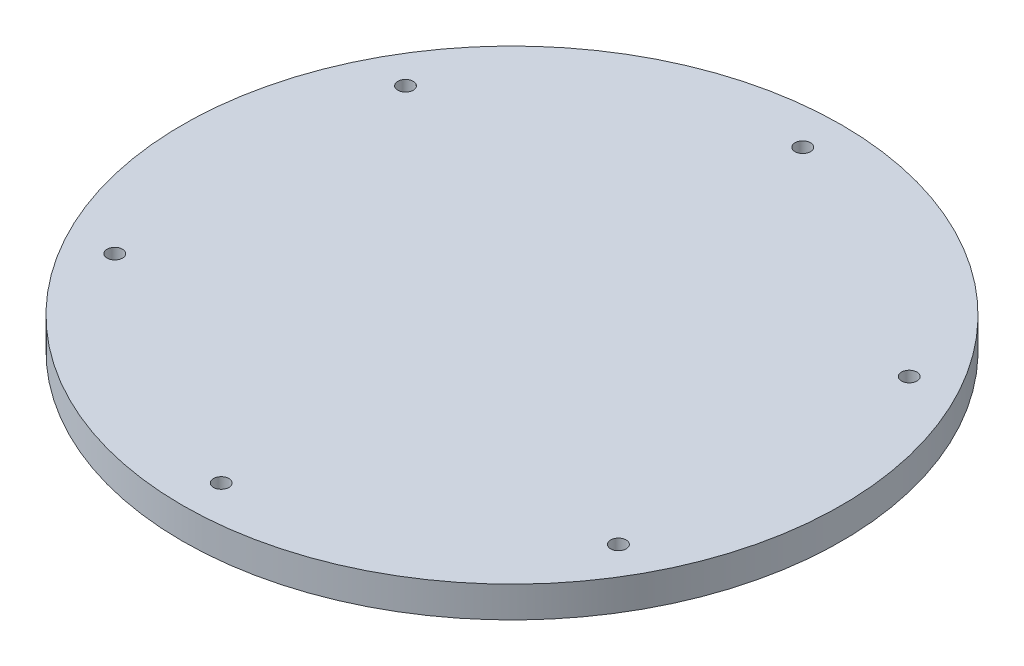
ISO-10303-21;
HEADER;
FILE_DESCRIPTION(('STEP AP214'),'2;1');
FILE_NAME('part.step','',(''),(''),'','','');
FILE_SCHEMA(('AUTOMOTIVE_DESIGN { 1 0 10303 214 1 1 1 1 }'));
ENDSEC;
DATA;
#1=APPLICATION_CONTEXT('core data for automotive mechanical design processes');
#2=APPLICATION_PROTOCOL_DEFINITION('international standard','automotive_design',2000,#1);
#3=PRODUCT_CONTEXT('',#1,'mechanical');
#4=PRODUCT('Part','Part','',(#3));
#5=PRODUCT_RELATED_PRODUCT_CATEGORY('part','',(#4));
#6=PRODUCT_DEFINITION_FORMATION('','',#4);
#7=PRODUCT_DEFINITION_CONTEXT('part definition',#1,'design');
#8=PRODUCT_DEFINITION('design','',#6,#7);
#9=PRODUCT_DEFINITION_SHAPE('','',#8);
#10=(LENGTH_UNIT() NAMED_UNIT(*) SI_UNIT(.MILLI.,.METRE.));
#11=(NAMED_UNIT(*) PLANE_ANGLE_UNIT() SI_UNIT($,.RADIAN.));
#12=(NAMED_UNIT(*) SI_UNIT($,.STERADIAN.) SOLID_ANGLE_UNIT());
#13=UNCERTAINTY_MEASURE_WITH_UNIT(LENGTH_MEASURE(1.E-05),#10,'distance_accuracy_value','');
#14=(GEOMETRIC_REPRESENTATION_CONTEXT(3) GLOBAL_UNCERTAINTY_ASSIGNED_CONTEXT((#13)) GLOBAL_UNIT_ASSIGNED_CONTEXT((#10,
#11,#12)) REPRESENTATION_CONTEXT('',''));
#15=CARTESIAN_POINT('',(0.,0.,0.));
#16=DIRECTION('',(0.,0.,1.));
#17=DIRECTION('',(1.,0.,0.));
#18=AXIS2_PLACEMENT_3D('',#15,#16,#17);
#19=CARTESIAN_POINT('',(0.,8.,0.));
#20=DIRECTION('',(0.,-1.,0.));
#21=DIRECTION('',(0.,0.,-1.));
#22=AXIS2_PLACEMENT_3D('',#19,#20,#21);
#23=CYLINDRICAL_SURFACE('',#22,85.);
#24=CARTESIAN_POINT('',(0.,8.,0.));
#25=DIRECTION('',(0.,1.,0.));
#26=DIRECTION('',(0.,0.,1.));
#27=AXIS2_PLACEMENT_3D('',#24,#25,#26);
#28=CIRCLE('',#27,85.);
#29=CARTESIAN_POINT('',(0.,8.,85.));
#30=VERTEX_POINT('',#29);
#31=EDGE_CURVE('E10',#30,#30,#28,.T.);
#32=ORIENTED_EDGE('',*,*,#31,.F.);
#33=EDGE_LOOP('',(#32));
#34=FACE_BOUND('',#33,.T.);
#35=CARTESIAN_POINT('',(0.,0.,0.));
#36=DIRECTION('',(0.,1.,0.));
#37=DIRECTION('',(0.,0.,1.));
#38=AXIS2_PLACEMENT_3D('',#35,#36,#37);
#39=CIRCLE('',#38,85.);
#40=CARTESIAN_POINT('',(0.,0.,85.));
#41=VERTEX_POINT('',#40);
#42=EDGE_CURVE('E40',#41,#41,#39,.T.);
#43=ORIENTED_EDGE('',*,*,#42,.T.);
#44=EDGE_LOOP('',(#43));
#45=FACE_BOUND('',#44,.T.);
#46=ADVANCED_FACE('F37',(#34,#45),#23,.T.);
#47=CARTESIAN_POINT('',(0.,8.,0.));
#48=DIRECTION('',(0.,1.,0.));
#49=DIRECTION('',(0.,0.,1.));
#50=AXIS2_PLACEMENT_3D('',#47,#48,#49);
#51=PLANE('',#50);
#52=CARTESIAN_POINT('',(64.9519052838325,8.,37.5000000000008));
#53=DIRECTION('',(0.,1.,0.));
#54=DIRECTION('',(0.,0.,1.));
#55=AXIS2_PLACEMENT_3D('',#52,#53,#54);
#56=CIRCLE('',#55,2.00000000000001);
#57=CARTESIAN_POINT('',(64.9519052838325,8.,39.5000000000008));
#58=VERTEX_POINT('',#57);
#59=EDGE_CURVE('E63',#58,#58,#56,.T.);
#60=ORIENTED_EDGE('',*,*,#59,.F.);
#61=EDGE_LOOP('',(#60));
#62=FACE_BOUND('',#61,.T.);
#63=CARTESIAN_POINT('',(0.,8.,75.));
#64=DIRECTION('',(0.,1.,0.));
#65=DIRECTION('',(0.,0.,1.));
#66=AXIS2_PLACEMENT_3D('',#63,#64,#65);
#67=CIRCLE('',#66,2.);
#68=CARTESIAN_POINT('',(0.,8.,77.));
#69=VERTEX_POINT('',#68);
#70=EDGE_CURVE('E71',#69,#69,#67,.T.);
#71=ORIENTED_EDGE('',*,*,#70,.F.);
#72=EDGE_LOOP('',(#71));
#73=FACE_BOUND('',#72,.T.);
#74=CARTESIAN_POINT('',(-64.951905283833,8.,37.4999999999999));
#75=DIRECTION('',(0.,1.,0.));
#76=DIRECTION('',(0.,0.,1.));
#77=AXIS2_PLACEMENT_3D('',#74,#75,#76);
#78=CIRCLE('',#77,2.00000000000001);
#79=CARTESIAN_POINT('',(-64.951905283833,8.,39.4999999999999));
#80=VERTEX_POINT('',#79);
#81=EDGE_CURVE('E79',#80,#80,#78,.T.);
#82=ORIENTED_EDGE('',*,*,#81,.F.);
#83=EDGE_LOOP('',(#82));
#84=FACE_BOUND('',#83,.T.);
#85=CARTESIAN_POINT('',(-64.9519052838327,8.,-37.5000000000003));
#86=DIRECTION('',(0.,1.,0.));
#87=DIRECTION('',(0.,0.,1.));
#88=AXIS2_PLACEMENT_3D('',#85,#86,#87);
#89=CIRCLE('',#88,2.);
#90=CARTESIAN_POINT('',(-64.9519052838327,8.,-35.5000000000003));
#91=VERTEX_POINT('',#90);
#92=EDGE_CURVE('E87',#91,#91,#89,.T.);
#93=ORIENTED_EDGE('',*,*,#92,.F.);
#94=EDGE_LOOP('',(#93));
#95=FACE_BOUND('',#94,.T.);
#96=CARTESIAN_POINT('',(5.2372220082647E-13,8.,-75.));
#97=DIRECTION('',(0.,1.,0.));
#98=DIRECTION('',(0.,0.,1.));
#99=AXIS2_PLACEMENT_3D('',#96,#97,#98);
#100=CIRCLE('',#99,2.);
#101=CARTESIAN_POINT('',(5.2372220082647E-13,8.,-73.));
#102=VERTEX_POINT('',#101);
#103=EDGE_CURVE('E55',#102,#102,#100,.T.);
#104=ORIENTED_EDGE('',*,*,#103,.F.);
#105=EDGE_LOOP('',(#104));
#106=FACE_BOUND('',#105,.T.);
#107=CARTESIAN_POINT('',(64.9519052838333,8.,-37.4999999999994));
#108=DIRECTION('',(0.,1.,0.));
#109=DIRECTION('',(0.,0.,1.));
#110=AXIS2_PLACEMENT_3D('',#107,#108,#109);
#111=CIRCLE('',#110,2.);
#112=CARTESIAN_POINT('',(64.9519052838333,8.,-35.4999999999994));
#113=VERTEX_POINT('',#112);
#114=EDGE_CURVE('E51',#113,#113,#111,.T.);
#115=ORIENTED_EDGE('',*,*,#114,.F.);
#116=EDGE_LOOP('',(#115));
#117=FACE_BOUND('',#116,.T.);
#118=ORIENTED_EDGE('',*,*,#31,.T.);
#119=EDGE_LOOP('',(#118));
#120=FACE_BOUND('',#119,.T.);
#121=ADVANCED_FACE('F101',(#62,#73,#84,#95,#106,#117,#120),#51,.T.);
#122=CARTESIAN_POINT('',(0.,0.,0.));
#123=DIRECTION('',(0.,1.,0.));
#124=DIRECTION('',(0.,0.,1.));
#125=AXIS2_PLACEMENT_3D('',#122,#123,#124);
#126=PLANE('',#125);
#127=CARTESIAN_POINT('',(64.9519052838325,0.,37.5000000000008));
#128=DIRECTION('',(0.,1.,0.));
#129=DIRECTION('',(0.,0.,1.));
#130=AXIS2_PLACEMENT_3D('',#127,#128,#129);
#131=CIRCLE('',#130,2.00000000000001);
#132=CARTESIAN_POINT('',(64.9519052838325,0.,39.5000000000008));
#133=VERTEX_POINT('',#132);
#134=EDGE_CURVE('E59',#133,#133,#131,.T.);
#135=ORIENTED_EDGE('',*,*,#134,.T.);
#136=EDGE_LOOP('',(#135));
#137=FACE_BOUND('',#136,.T.);
#138=CARTESIAN_POINT('',(0.,0.,75.));
#139=DIRECTION('',(0.,1.,0.));
#140=DIRECTION('',(0.,0.,1.));
#141=AXIS2_PLACEMENT_3D('',#138,#139,#140);
#142=CIRCLE('',#141,2.);
#143=CARTESIAN_POINT('',(0.,0.,77.));
#144=VERTEX_POINT('',#143);
#145=EDGE_CURVE('E67',#144,#144,#142,.T.);
#146=ORIENTED_EDGE('',*,*,#145,.T.);
#147=EDGE_LOOP('',(#146));
#148=FACE_BOUND('',#147,.T.);
#149=CARTESIAN_POINT('',(-64.951905283833,0.,37.4999999999999));
#150=DIRECTION('',(0.,1.,0.));
#151=DIRECTION('',(0.,0.,1.));
#152=AXIS2_PLACEMENT_3D('',#149,#150,#151);
#153=CIRCLE('',#152,2.00000000000001);
#154=CARTESIAN_POINT('',(-64.951905283833,0.,39.4999999999999));
#155=VERTEX_POINT('',#154);
#156=EDGE_CURVE('E75',#155,#155,#153,.T.);
#157=ORIENTED_EDGE('',*,*,#156,.T.);
#158=EDGE_LOOP('',(#157));
#159=FACE_BOUND('',#158,.T.);
#160=CARTESIAN_POINT('',(-64.9519052838327,0.,-37.5000000000003));
#161=DIRECTION('',(0.,1.,0.));
#162=DIRECTION('',(0.,0.,1.));
#163=AXIS2_PLACEMENT_3D('',#160,#161,#162);
#164=CIRCLE('',#163,2.);
#165=CARTESIAN_POINT('',(-64.9519052838327,0.,-35.5000000000003));
#166=VERTEX_POINT('',#165);
#167=EDGE_CURVE('E83',#166,#166,#164,.T.);
#168=ORIENTED_EDGE('',*,*,#167,.T.);
#169=EDGE_LOOP('',(#168));
#170=FACE_BOUND('',#169,.T.);
#171=CARTESIAN_POINT('',(5.2372220082647E-13,0.,-75.));
#172=DIRECTION('',(0.,1.,0.));
#173=DIRECTION('',(0.,0.,1.));
#174=AXIS2_PLACEMENT_3D('',#171,#172,#173);
#175=CIRCLE('',#174,2.);
#176=CARTESIAN_POINT('',(5.2372220082647E-13,0.,-73.));
#177=VERTEX_POINT('',#176);
#178=EDGE_CURVE('E91',#177,#177,#175,.T.);
#179=ORIENTED_EDGE('',*,*,#178,.T.);
#180=EDGE_LOOP('',(#179));
#181=FACE_BOUND('',#180,.T.);
#182=CARTESIAN_POINT('',(64.9519052838333,0.,-37.4999999999994));
#183=DIRECTION('',(0.,1.,0.));
#184=DIRECTION('',(0.,0.,1.));
#185=AXIS2_PLACEMENT_3D('',#182,#183,#184);
#186=CIRCLE('',#185,2.);
#187=CARTESIAN_POINT('',(64.9519052838333,0.,-35.4999999999994));
#188=VERTEX_POINT('',#187);
#189=EDGE_CURVE('E49',#188,#188,#186,.T.);
#190=ORIENTED_EDGE('',*,*,#189,.T.);
#191=EDGE_LOOP('',(#190));
#192=FACE_BOUND('',#191,.T.);
#193=ORIENTED_EDGE('',*,*,#42,.F.);
#194=EDGE_LOOP('',(#193));
#195=FACE_BOUND('',#194,.T.);
#196=ADVANCED_FACE('F104',(#137,#148,#159,#170,#181,#192,#195),#126,.F.);
#197=CARTESIAN_POINT('',(64.9519052838333,0.,-37.4999999999994));
#198=DIRECTION('',(0.,1.,0.));
#199=DIRECTION('',(0.,0.,1.));
#200=AXIS2_PLACEMENT_3D('',#197,#198,#199);
#201=CYLINDRICAL_SURFACE('',#200,2.);
#202=ORIENTED_EDGE('',*,*,#189,.F.);
#203=EDGE_LOOP('',(#202));
#204=FACE_BOUND('',#203,.T.);
#205=ORIENTED_EDGE('',*,*,#114,.T.);
#206=EDGE_LOOP('',(#205));
#207=FACE_BOUND('',#206,.T.);
#208=ADVANCED_FACE('F109',(#204,#207),#201,.F.);
#209=CARTESIAN_POINT('',(5.2372220082647E-13,0.,-75.));
#210=DIRECTION('',(0.,1.,0.));
#211=DIRECTION('',(0.,0.,1.));
#212=AXIS2_PLACEMENT_3D('',#209,#210,#211);
#213=CYLINDRICAL_SURFACE('',#212,2.);
#214=ORIENTED_EDGE('',*,*,#178,.F.);
#215=EDGE_LOOP('',(#214));
#216=FACE_BOUND('',#215,.T.);
#217=ORIENTED_EDGE('',*,*,#103,.T.);
#218=EDGE_LOOP('',(#217));
#219=FACE_BOUND('',#218,.T.);
#220=ADVANCED_FACE('F99',(#216,#219),#213,.F.);
#221=CARTESIAN_POINT('',(-64.9519052838327,0.,-37.5000000000003));
#222=DIRECTION('',(0.,1.,0.));
#223=DIRECTION('',(0.,0.,1.));
#224=AXIS2_PLACEMENT_3D('',#221,#222,#223);
#225=CYLINDRICAL_SURFACE('',#224,2.);
#226=ORIENTED_EDGE('',*,*,#167,.F.);
#227=EDGE_LOOP('',(#226));
#228=FACE_BOUND('',#227,.T.);
#229=ORIENTED_EDGE('',*,*,#92,.T.);
#230=EDGE_LOOP('',(#229));
#231=FACE_BOUND('',#230,.T.);
#232=ADVANCED_FACE('F117',(#228,#231),#225,.F.);
#233=CARTESIAN_POINT('',(-64.951905283833,0.,37.4999999999999));
#234=DIRECTION('',(0.,1.,0.));
#235=DIRECTION('',(0.,0.,1.));
#236=AXIS2_PLACEMENT_3D('',#233,#234,#235);
#237=CYLINDRICAL_SURFACE('',#236,2.00000000000001);
#238=ORIENTED_EDGE('',*,*,#156,.F.);
#239=EDGE_LOOP('',(#238));
#240=FACE_BOUND('',#239,.T.);
#241=ORIENTED_EDGE('',*,*,#81,.T.);
#242=EDGE_LOOP('',(#241));
#243=FACE_BOUND('',#242,.T.);
#244=ADVANCED_FACE('F157',(#240,#243),#237,.F.);
#245=CARTESIAN_POINT('',(0.,0.,75.));
#246=DIRECTION('',(0.,1.,0.));
#247=DIRECTION('',(0.,0.,1.));
#248=AXIS2_PLACEMENT_3D('',#245,#246,#247);
#249=CYLINDRICAL_SURFACE('',#248,2.);
#250=ORIENTED_EDGE('',*,*,#145,.F.);
#251=EDGE_LOOP('',(#250));
#252=FACE_BOUND('',#251,.T.);
#253=ORIENTED_EDGE('',*,*,#70,.T.);
#254=EDGE_LOOP('',(#253));
#255=FACE_BOUND('',#254,.T.);
#256=ADVANCED_FACE('F167',(#252,#255),#249,.F.);
#257=CARTESIAN_POINT('',(64.9519052838325,0.,37.5000000000008));
#258=DIRECTION('',(0.,1.,0.));
#259=DIRECTION('',(0.,0.,1.));
#260=AXIS2_PLACEMENT_3D('',#257,#258,#259);
#261=CYLINDRICAL_SURFACE('',#260,2.00000000000001);
#262=ORIENTED_EDGE('',*,*,#134,.F.);
#263=EDGE_LOOP('',(#262));
#264=FACE_BOUND('',#263,.T.);
#265=ORIENTED_EDGE('',*,*,#59,.T.);
#266=EDGE_LOOP('',(#265));
#267=FACE_BOUND('',#266,.T.);
#268=ADVANCED_FACE('F177',(#264,#267),#261,.F.);
#269=CLOSED_SHELL('',(#46,#121,#196,#208,#220,#232,#244,#256,#268));
#270=MANIFOLD_SOLID_BREP('B2',#269);
#271=ADVANCED_BREP_SHAPE_REPRESENTATION('',(#18,#270),#14);
#272=SHAPE_DEFINITION_REPRESENTATION(#9,#271);
ENDSEC;
END-ISO-10303-21;
